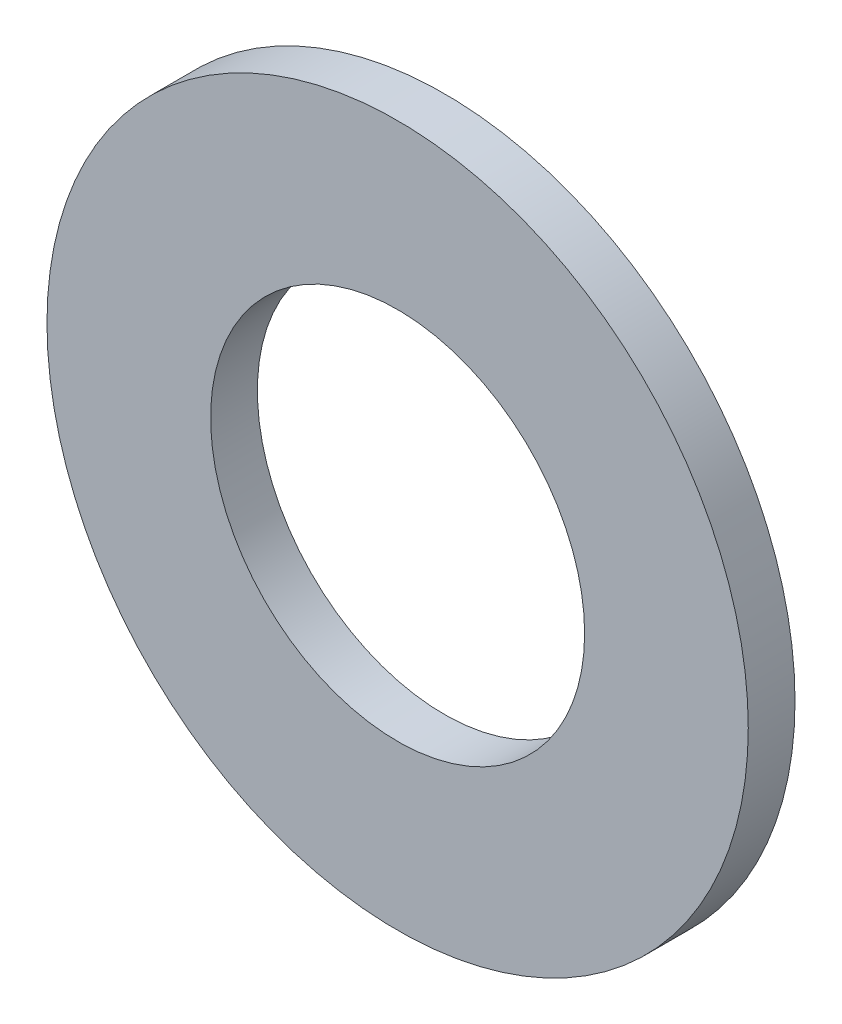
ISO-10303-21;
HEADER;
FILE_DESCRIPTION(('STEP AP214'),'2;1');
FILE_NAME('part.step','',(''),(''),'','','');
FILE_SCHEMA(('AUTOMOTIVE_DESIGN { 1 0 10303 214 1 1 1 1 }'));
ENDSEC;
DATA;
#1=APPLICATION_CONTEXT('core data for automotive mechanical design processes');
#2=APPLICATION_PROTOCOL_DEFINITION('international standard','automotive_design',2000,#1);
#3=PRODUCT_CONTEXT('',#1,'mechanical');
#4=PRODUCT('Part','Part','',(#3));
#5=PRODUCT_RELATED_PRODUCT_CATEGORY('part','',(#4));
#6=PRODUCT_DEFINITION_FORMATION('','',#4);
#7=PRODUCT_DEFINITION_CONTEXT('part definition',#1,'design');
#8=PRODUCT_DEFINITION('design','',#6,#7);
#9=PRODUCT_DEFINITION_SHAPE('','',#8);
#10=(LENGTH_UNIT() NAMED_UNIT(*) SI_UNIT(.MILLI.,.METRE.));
#11=(NAMED_UNIT(*) PLANE_ANGLE_UNIT() SI_UNIT($,.RADIAN.));
#12=(NAMED_UNIT(*) SI_UNIT($,.STERADIAN.) SOLID_ANGLE_UNIT());
#13=UNCERTAINTY_MEASURE_WITH_UNIT(LENGTH_MEASURE(1.E-05),#10,'distance_accuracy_value','');
#14=(GEOMETRIC_REPRESENTATION_CONTEXT(3) GLOBAL_UNCERTAINTY_ASSIGNED_CONTEXT((#13)) GLOBAL_UNIT_ASSIGNED_CONTEXT((#10,
#11,#12)) REPRESENTATION_CONTEXT('',''));
#15=CARTESIAN_POINT('',(0.,0.,0.));
#16=DIRECTION('',(0.,0.,1.));
#17=DIRECTION('',(1.,0.,0.));
#18=AXIS2_PLACEMENT_3D('',#15,#16,#17);
#19=CARTESIAN_POINT('',(0.,0.,0.));
#20=DIRECTION('',(0.,0.,1.));
#21=DIRECTION('',(1.,0.,0.));
#22=AXIS2_PLACEMENT_3D('',#19,#20,#21);
#23=PLANE('',#22);
#24=CARTESIAN_POINT('',(0.,0.,0.));
#25=DIRECTION('',(0.,0.,1.));
#26=DIRECTION('',(1.,0.,0.));
#27=AXIS2_PLACEMENT_3D('',#24,#25,#26);
#28=CIRCLE('',#27,2.);
#29=CARTESIAN_POINT('',(2.,0.,0.));
#30=VERTEX_POINT('',#29);
#31=EDGE_CURVE('E26',#30,#30,#28,.T.);
#32=ORIENTED_EDGE('',*,*,#31,.T.);
#33=EDGE_LOOP('',(#32));
#34=FACE_BOUND('',#33,.T.);
#35=CARTESIAN_POINT('',(0.,0.,0.));
#36=DIRECTION('',(0.,0.,1.));
#37=DIRECTION('',(1.,0.,0.));
#38=AXIS2_PLACEMENT_3D('',#35,#36,#37);
#39=CIRCLE('',#38,3.75);
#40=CARTESIAN_POINT('',(3.75,0.,0.));
#41=VERTEX_POINT('',#40);
#42=EDGE_CURVE('E17',#41,#41,#39,.T.);
#43=ORIENTED_EDGE('',*,*,#42,.F.);
#44=EDGE_LOOP('',(#43));
#45=FACE_BOUND('',#44,.T.);
#46=ADVANCED_FACE('F14',(#34,#45),#23,.F.);
#47=CARTESIAN_POINT('',(0.,0.,0.));
#48=DIRECTION('',(0.,0.,1.));
#49=DIRECTION('',(1.,0.,0.));
#50=AXIS2_PLACEMENT_3D('',#47,#48,#49);
#51=CYLINDRICAL_SURFACE('',#50,3.75);
#52=ORIENTED_EDGE('',*,*,#42,.T.);
#53=EDGE_LOOP('',(#52));
#54=FACE_BOUND('',#53,.T.);
#55=CARTESIAN_POINT('',(0.,0.,0.5));
#56=DIRECTION('',(0.,0.,1.));
#57=DIRECTION('',(1.,0.,0.));
#58=AXIS2_PLACEMENT_3D('',#55,#56,#57);
#59=CIRCLE('',#58,3.75);
#60=CARTESIAN_POINT('',(3.75,0.,0.5));
#61=VERTEX_POINT('',#60);
#62=EDGE_CURVE('E21',#61,#61,#59,.T.);
#63=ORIENTED_EDGE('',*,*,#62,.F.);
#64=EDGE_LOOP('',(#63));
#65=FACE_BOUND('',#64,.T.);
#66=ADVANCED_FACE('F34',(#54,#65),#51,.T.);
#67=CARTESIAN_POINT('',(0.,0.,0.));
#68=DIRECTION('',(0.,0.,1.));
#69=DIRECTION('',(1.,0.,0.));
#70=AXIS2_PLACEMENT_3D('',#67,#68,#69);
#71=CYLINDRICAL_SURFACE('',#70,2.);
#72=ORIENTED_EDGE('',*,*,#31,.F.);
#73=EDGE_LOOP('',(#72));
#74=FACE_BOUND('',#73,.T.);
#75=CARTESIAN_POINT('',(0.,0.,0.5));
#76=DIRECTION('',(0.,0.,1.));
#77=DIRECTION('',(1.,0.,0.));
#78=AXIS2_PLACEMENT_3D('',#75,#76,#77);
#79=CIRCLE('',#78,2.);
#80=CARTESIAN_POINT('',(2.,0.,0.5));
#81=VERTEX_POINT('',#80);
#82=EDGE_CURVE('E10',#81,#81,#79,.F.);
#83=ORIENTED_EDGE('',*,*,#82,.F.);
#84=EDGE_LOOP('',(#83));
#85=FACE_BOUND('',#84,.T.);
#86=ADVANCED_FACE('F42',(#74,#85),#71,.F.);
#87=CARTESIAN_POINT('',(0.,0.,0.5));
#88=DIRECTION('',(0.,0.,1.));
#89=DIRECTION('',(1.,0.,0.));
#90=AXIS2_PLACEMENT_3D('',#87,#88,#89);
#91=PLANE('',#90);
#92=ORIENTED_EDGE('',*,*,#82,.T.);
#93=EDGE_LOOP('',(#92));
#94=FACE_BOUND('',#93,.T.);
#95=ORIENTED_EDGE('',*,*,#62,.T.);
#96=EDGE_LOOP('',(#95));
#97=FACE_BOUND('',#96,.T.);
#98=ADVANCED_FACE('F43',(#94,#97),#91,.T.);
#99=CLOSED_SHELL('',(#46,#66,#86,#98));
#100=MANIFOLD_SOLID_BREP('B1',#99);
#101=ADVANCED_BREP_SHAPE_REPRESENTATION('',(#18,#100),#14);
#102=SHAPE_DEFINITION_REPRESENTATION(#9,#101);
ENDSEC;
END-ISO-10303-21;
